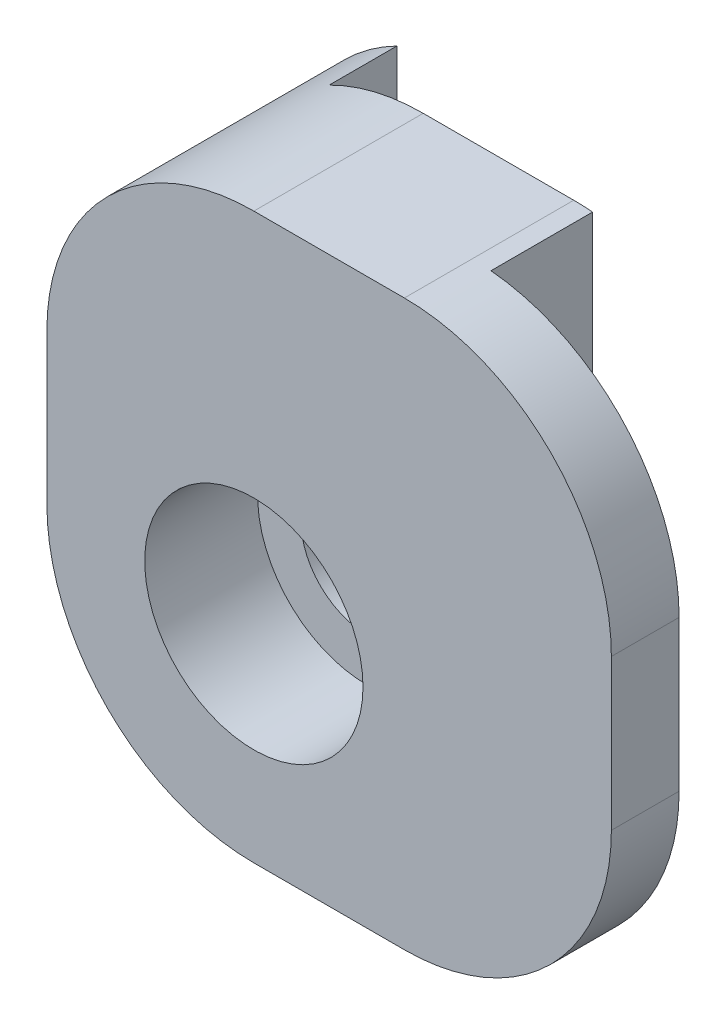
ISO-10303-21;
HEADER;
FILE_DESCRIPTION(('STEP AP214'),'2;1');
FILE_NAME('part.step','',(''),(''),'','','');
FILE_SCHEMA(('AUTOMOTIVE_DESIGN { 1 0 10303 214 1 1 1 1 }'));
ENDSEC;
DATA;
#1=APPLICATION_CONTEXT('core data for automotive mechanical design processes');
#2=APPLICATION_PROTOCOL_DEFINITION('international standard','automotive_design',2000,#1);
#3=PRODUCT_CONTEXT('',#1,'mechanical');
#4=PRODUCT('Part','Part','',(#3));
#5=PRODUCT_RELATED_PRODUCT_CATEGORY('part','',(#4));
#6=PRODUCT_DEFINITION_FORMATION('','',#4);
#7=PRODUCT_DEFINITION_CONTEXT('part definition',#1,'design');
#8=PRODUCT_DEFINITION('design','',#6,#7);
#9=PRODUCT_DEFINITION_SHAPE('','',#8);
#10=(LENGTH_UNIT() NAMED_UNIT(*) SI_UNIT(.MILLI.,.METRE.));
#11=(NAMED_UNIT(*) PLANE_ANGLE_UNIT() SI_UNIT($,.RADIAN.));
#12=(NAMED_UNIT(*) SI_UNIT($,.STERADIAN.) SOLID_ANGLE_UNIT());
#13=UNCERTAINTY_MEASURE_WITH_UNIT(LENGTH_MEASURE(1.E-05),#10,'distance_accuracy_value','');
#14=(GEOMETRIC_REPRESENTATION_CONTEXT(3) GLOBAL_UNCERTAINTY_ASSIGNED_CONTEXT((#13)) GLOBAL_UNIT_ASSIGNED_CONTEXT((#10,
#11,#12)) REPRESENTATION_CONTEXT('',''));
#15=CARTESIAN_POINT('',(0.,0.,0.));
#16=DIRECTION('',(0.,0.,1.));
#17=DIRECTION('',(1.,0.,0.));
#18=AXIS2_PLACEMENT_3D('',#15,#16,#17);
#19=CARTESIAN_POINT('',(10.5,2.5,2.7));
#20=DIRECTION('',(0.,0.,-1.));
#21=DIRECTION('',(1.,0.,0.));
#22=AXIS2_PLACEMENT_3D('',#19,#20,#21);
#23=CYLINDRICAL_SURFACE('',#22,1.75);
#24=CARTESIAN_POINT('',(10.5,2.5,0.));
#25=DIRECTION('',(0.,0.,-1.));
#26=DIRECTION('',(-1.,0.,0.));
#27=AXIS2_PLACEMENT_3D('',#24,#25,#26);
#28=CIRCLE('',#27,1.75);
#29=CARTESIAN_POINT('',(8.75,2.5,0.));
#30=VERTEX_POINT('',#29);
#31=EDGE_CURVE('E197',#30,#30,#28,.T.);
#32=ORIENTED_EDGE('',*,*,#31,.T.);
#33=EDGE_LOOP('',(#32));
#34=FACE_BOUND('',#33,.T.);
#35=CARTESIAN_POINT('',(10.5,2.5,1.5));
#36=DIRECTION('',(0.,0.,1.));
#37=DIRECTION('',(1.,0.,0.));
#38=AXIS2_PLACEMENT_3D('',#35,#36,#37);
#39=CIRCLE('',#38,1.75);
#40=CARTESIAN_POINT('',(12.25,2.5,1.5));
#41=VERTEX_POINT('',#40);
#42=EDGE_CURVE('E42',#41,#41,#39,.T.);
#43=ORIENTED_EDGE('',*,*,#42,.T.);
#44=EDGE_LOOP('',(#43));
#45=FACE_BOUND('',#44,.T.);
#46=ADVANCED_FACE('F38',(#34,#45),#23,.F.);
#47=CARTESIAN_POINT('',(20.,0.,0.));
#48=DIRECTION('',(1.,0.,0.));
#49=DIRECTION('',(0.,0.,1.));
#50=AXIS2_PLACEMENT_3D('',#47,#48,#49);
#51=PLANE('',#50);
#52=DIRECTION('',(0.,0.,1.));
#53=VECTOR('',#52,1.);
#54=CARTESIAN_POINT('',(20.,6.5,-9.27817459305208));
#55=LINE('',#54,#53);
#56=CARTESIAN_POINT('',(20.,6.5,4.5));
#57=VERTEX_POINT('',#56);
#58=CARTESIAN_POINT('',(20.,6.5,2.7));
#59=VERTEX_POINT('',#58);
#60=EDGE_CURVE('E11',#57,#59,#55,.F.);
#61=ORIENTED_EDGE('',*,*,#60,.F.);
#62=DIRECTION('',(0.,1.,0.));
#63=VECTOR('',#62,1.);
#64=CARTESIAN_POINT('',(20.,2.5,4.5));
#65=LINE('',#64,#63);
#66=CARTESIAN_POINT('',(20.,2.5,4.5));
#67=VERTEX_POINT('',#66);
#68=EDGE_CURVE('E134',#67,#57,#65,.T.);
#69=ORIENTED_EDGE('',*,*,#68,.F.);
#70=DIRECTION('',(0.,0.,1.));
#71=VECTOR('',#70,1.);
#72=CARTESIAN_POINT('',(20.,2.5,-9.27817459305202));
#73=LINE('',#72,#71);
#74=CARTESIAN_POINT('',(20.,2.5,2.7));
#75=VERTEX_POINT('',#74);
#76=EDGE_CURVE('E144',#75,#67,#73,.T.);
#77=ORIENTED_EDGE('',*,*,#76,.F.);
#78=DIRECTION('',(0.,-1.,0.));
#79=VECTOR('',#78,1.);
#80=CARTESIAN_POINT('',(20.,12.,2.7));
#81=LINE('',#80,#79);
#82=EDGE_CURVE('E195',#59,#75,#81,.T.);
#83=ORIENTED_EDGE('',*,*,#82,.F.);
#84=EDGE_LOOP('',(#61,#69,#77,#83));
#85=FACE_BOUND('',#84,.T.);
#86=ADVANCED_FACE('F142',(#85),#51,.T.);
#87=CARTESIAN_POINT('',(8.,12.,2.7));
#88=DIRECTION('',(0.,-1.,0.));
#89=DIRECTION('',(0.,0.,-1.));
#90=AXIS2_PLACEMENT_3D('',#87,#88,#89);
#91=PLANE('',#90);
#92=DIRECTION('',(-1.,0.,0.));
#93=VECTOR('',#92,1.);
#94=CARTESIAN_POINT('',(14.5,12.,4.5));
#95=LINE('',#94,#93);
#96=CARTESIAN_POINT('',(14.5,12.,4.5));
#97=VERTEX_POINT('',#96);
#98=CARTESIAN_POINT('',(10.5,12.,4.5));
#99=VERTEX_POINT('',#98);
#100=EDGE_CURVE('E273',#97,#99,#95,.T.);
#101=ORIENTED_EDGE('',*,*,#100,.F.);
#102=DIRECTION('',(0.,0.,1.));
#103=VECTOR('',#102,1.);
#104=CARTESIAN_POINT('',(14.5,12.,-9.27817459305208));
#105=LINE('',#104,#103);
#106=CARTESIAN_POINT('',(14.5,12.,0.));
#107=VERTEX_POINT('',#106);
#108=EDGE_CURVE('E163',#107,#97,#105,.T.);
#109=ORIENTED_EDGE('',*,*,#108,.F.);
#110=DIRECTION('',(1.,0.,0.));
#111=VECTOR('',#110,1.);
#112=CARTESIAN_POINT('',(8.,12.,0.));
#113=LINE('',#112,#111);
#114=CARTESIAN_POINT('',(10.5,12.,0.));
#115=VERTEX_POINT('',#114);
#116=EDGE_CURVE('E202',#115,#107,#113,.T.);
#117=ORIENTED_EDGE('',*,*,#116,.F.);
#118=DIRECTION('',(0.,0.,1.));
#119=VECTOR('',#118,1.);
#120=CARTESIAN_POINT('',(10.5,12.,-9.27817459305208));
#121=LINE('',#120,#119);
#122=EDGE_CURVE('E167',#115,#99,#121,.T.);
#123=ORIENTED_EDGE('',*,*,#122,.T.);
#124=EDGE_LOOP('',(#101,#109,#117,#123));
#125=FACE_BOUND('',#124,.T.);
#126=ADVANCED_FACE('F272',(#125),#91,.F.);
#127=CARTESIAN_POINT('',(8.,-3.,0.));
#128=DIRECTION('',(0.,-1.,0.));
#129=DIRECTION('',(-1.,0.,0.));
#130=AXIS2_PLACEMENT_3D('',#127,#128,#129);
#131=PLANE('',#130);
#132=DIRECTION('',(0.,0.,1.));
#133=VECTOR('',#132,1.);
#134=CARTESIAN_POINT('',(14.5,-3.,-9.27817459305202));
#135=LINE('',#134,#133);
#136=CARTESIAN_POINT('',(14.5,-3.,-1.8));
#137=VERTEX_POINT('',#136);
#138=CARTESIAN_POINT('',(14.5,-3.,4.5));
#139=VERTEX_POINT('',#138);
#140=EDGE_CURVE('E151',#137,#139,#135,.T.);
#141=ORIENTED_EDGE('',*,*,#140,.T.);
#142=DIRECTION('',(1.,0.,0.));
#143=VECTOR('',#142,1.);
#144=CARTESIAN_POINT('',(10.5,-3.,4.5));
#145=LINE('',#144,#143);
#146=CARTESIAN_POINT('',(10.5,-3.,4.5));
#147=VERTEX_POINT('',#146);
#148=EDGE_CURVE('E54',#147,#139,#145,.T.);
#149=ORIENTED_EDGE('',*,*,#148,.F.);
#150=DIRECTION('',(0.,0.,-1.));
#151=VECTOR('',#150,1.);
#152=CARTESIAN_POINT('',(10.5,-3.,0.));
#153=LINE('',#152,#151);
#154=CARTESIAN_POINT('',(10.5,-3.,-1.8));
#155=VERTEX_POINT('',#154);
#156=EDGE_CURVE('E47',#155,#147,#153,.F.);
#157=ORIENTED_EDGE('',*,*,#156,.F.);
#158=DIRECTION('',(1.,0.,0.));
#159=VECTOR('',#158,1.);
#160=CARTESIAN_POINT('',(10.5,-3.,-1.8));
#161=LINE('',#160,#159);
#162=EDGE_CURVE('E222',#155,#137,#161,.T.);
#163=ORIENTED_EDGE('',*,*,#162,.T.);
#164=EDGE_LOOP('',(#141,#149,#157,#163));
#165=FACE_BOUND('',#164,.T.);
#166=ADVANCED_FACE('F221',(#165),#131,.T.);
#167=CARTESIAN_POINT('',(5.,0.,0.));
#168=DIRECTION('',(-1.,0.,0.));
#169=DIRECTION('',(0.,0.,-1.));
#170=AXIS2_PLACEMENT_3D('',#167,#168,#169);
#171=PLANE('',#170);
#172=DIRECTION('',(0.,0.,-1.));
#173=VECTOR('',#172,1.);
#174=CARTESIAN_POINT('',(5.,2.5,0.));
#175=LINE('',#174,#173);
#176=CARTESIAN_POINT('',(5.,2.5,4.5));
#177=VERTEX_POINT('',#176);
#178=CARTESIAN_POINT('',(5.,2.5,-1.8));
#179=VERTEX_POINT('',#178);
#180=EDGE_CURVE('E208',#177,#179,#175,.T.);
#181=ORIENTED_EDGE('',*,*,#180,.F.);
#182=DIRECTION('',(0.,-1.,0.));
#183=VECTOR('',#182,1.);
#184=CARTESIAN_POINT('',(5.,6.49999999999996,4.5));
#185=LINE('',#184,#183);
#186=CARTESIAN_POINT('',(5.,6.49999999999997,4.5));
#187=VERTEX_POINT('',#186);
#188=EDGE_CURVE('E227',#187,#177,#185,.T.);
#189=ORIENTED_EDGE('',*,*,#188,.F.);
#190=DIRECTION('',(0.,0.,1.));
#191=VECTOR('',#190,1.);
#192=CARTESIAN_POINT('',(5.,6.49999999999996,-9.27817459305208));
#193=LINE('',#192,#191);
#194=CARTESIAN_POINT('',(5.,6.49999999999997,-1.8));
#195=VERTEX_POINT('',#194);
#196=EDGE_CURVE('E162',#195,#187,#193,.T.);
#197=ORIENTED_EDGE('',*,*,#196,.F.);
#198=DIRECTION('',(0.,-1.,0.));
#199=VECTOR('',#198,1.);
#200=CARTESIAN_POINT('',(5.,6.49999999999996,-1.8));
#201=LINE('',#200,#199);
#202=EDGE_CURVE('E155',#195,#179,#201,.T.);
#203=ORIENTED_EDGE('',*,*,#202,.T.);
#204=EDGE_LOOP('',(#181,#189,#197,#203));
#205=FACE_BOUND('',#204,.T.);
#206=ADVANCED_FACE('F249',(#205),#171,.T.);
#207=CARTESIAN_POINT('',(10.5,2.5,1.8));
#208=DIRECTION('',(0.,0.,1.));
#209=DIRECTION('',(-1.,0.,0.));
#210=AXIS2_PLACEMENT_3D('',#207,#208,#209);
#211=CYLINDRICAL_SURFACE('',#210,2.9);
#212=CARTESIAN_POINT('',(10.5,2.5,4.5));
#213=DIRECTION('',(0.,0.,1.));
#214=DIRECTION('',(1.,0.,0.));
#215=AXIS2_PLACEMENT_3D('',#212,#213,#214);
#216=CIRCLE('',#215,2.9);
#217=CARTESIAN_POINT('',(13.4,2.5,4.5));
#218=VERTEX_POINT('',#217);
#219=EDGE_CURVE('E223',#218,#218,#216,.F.);
#220=ORIENTED_EDGE('',*,*,#219,.F.);
#221=EDGE_LOOP('',(#220));
#222=FACE_BOUND('',#221,.T.);
#223=CARTESIAN_POINT('',(10.5,2.5,1.5));
#224=DIRECTION('',(0.,0.,1.));
#225=DIRECTION('',(1.,0.,0.));
#226=AXIS2_PLACEMENT_3D('',#223,#224,#225);
#227=CIRCLE('',#226,2.9);
#228=CARTESIAN_POINT('',(13.4,2.5,1.5));
#229=VERTEX_POINT('',#228);
#230=EDGE_CURVE('E325',#229,#229,#227,.T.);
#231=ORIENTED_EDGE('',*,*,#230,.F.);
#232=EDGE_LOOP('',(#231));
#233=FACE_BOUND('',#232,.T.);
#234=ADVANCED_FACE('F314',(#222,#233),#211,.F.);
#235=CARTESIAN_POINT('',(10.5,2.5,0.));
#236=DIRECTION('',(0.,0.,-1.));
#237=DIRECTION('',(1.,0.,0.));
#238=AXIS2_PLACEMENT_3D('',#235,#236,#237);
#239=CYLINDRICAL_SURFACE('',#238,5.5);
#240=ORIENTED_EDGE('',*,*,#156,.T.);
#241=CARTESIAN_POINT('',(10.5,2.5,4.5));
#242=DIRECTION('',(0.,0.,1.));
#243=DIRECTION('',(1.,0.,0.));
#244=AXIS2_PLACEMENT_3D('',#241,#242,#243);
#245=CIRCLE('',#244,5.5);
#246=EDGE_CURVE('E214',#177,#147,#245,.T.);
#247=ORIENTED_EDGE('',*,*,#246,.F.);
#248=ORIENTED_EDGE('',*,*,#180,.T.);
#249=CARTESIAN_POINT('',(10.5,2.5,-1.8));
#250=DIRECTION('',(0.,0.,1.));
#251=DIRECTION('',(1.,0.,0.));
#252=AXIS2_PLACEMENT_3D('',#249,#250,#251);
#253=CIRCLE('',#252,5.5);
#254=EDGE_CURVE('E217',#179,#155,#253,.T.);
#255=ORIENTED_EDGE('',*,*,#254,.T.);
#256=EDGE_LOOP('',(#240,#247,#248,#255));
#257=FACE_BOUND('',#256,.T.);
#258=ADVANCED_FACE('F40',(#257),#239,.T.);
#259=CARTESIAN_POINT('',(10.5,6.5,-9.27817459305208));
#260=DIRECTION('',(0.,0.,1.));
#261=DIRECTION('',(-1.,0.,0.));
#262=AXIS2_PLACEMENT_3D('',#259,#260,#261);
#263=CYLINDRICAL_SURFACE('',#262,5.5);
#264=CARTESIAN_POINT('',(10.5,6.5,4.5));
#265=DIRECTION('',(0.,0.,1.));
#266=DIRECTION('',(1.,0.,0.));
#267=AXIS2_PLACEMENT_3D('',#264,#265,#266);
#268=CIRCLE('',#267,5.5);
#269=EDGE_CURVE('E275',#99,#187,#268,.T.);
#270=ORIENTED_EDGE('',*,*,#269,.F.);
#271=ORIENTED_EDGE('',*,*,#122,.F.);
#272=CARTESIAN_POINT('',(10.5,6.5,0.));
#273=DIRECTION('',(0.,0.,-1.));
#274=DIRECTION('',(-1.,0.,0.));
#275=AXIS2_PLACEMENT_3D('',#272,#273,#274);
#276=CIRCLE('',#275,5.5);
#277=CARTESIAN_POINT('',(8.,11.3989794855664,0.));
#278=VERTEX_POINT('',#277);
#279=EDGE_CURVE('E174',#115,#278,#276,.F.);
#280=ORIENTED_EDGE('',*,*,#279,.T.);
#281=DIRECTION('',(0.,0.,1.));
#282=VECTOR('',#281,1.);
#283=CARTESIAN_POINT('',(8.,11.3989794855664,-9.27817459305208));
#284=LINE('',#283,#282);
#285=CARTESIAN_POINT('',(8.,11.3989794855664,-1.8));
#286=VERTEX_POINT('',#285);
#287=EDGE_CURVE('E166',#278,#286,#284,.F.);
#288=ORIENTED_EDGE('',*,*,#287,.T.);
#289=CARTESIAN_POINT('',(10.5,6.5,-1.8));
#290=DIRECTION('',(0.,0.,1.));
#291=DIRECTION('',(1.,0.,0.));
#292=AXIS2_PLACEMENT_3D('',#289,#290,#291);
#293=CIRCLE('',#292,5.5);
#294=EDGE_CURVE('E243',#286,#195,#293,.T.);
#295=ORIENTED_EDGE('',*,*,#294,.T.);
#296=ORIENTED_EDGE('',*,*,#196,.T.);
#297=EDGE_LOOP('',(#270,#271,#280,#288,#295,#296));
#298=FACE_BOUND('',#297,.T.);
#299=ADVANCED_FACE('F279',(#298),#263,.T.);
#300=CARTESIAN_POINT('',(14.5,6.5,-9.27817459305208));
#301=DIRECTION('',(0.,0.,1.));
#302=DIRECTION('',(-1.,0.,0.));
#303=AXIS2_PLACEMENT_3D('',#300,#301,#302);
#304=CYLINDRICAL_SURFACE('',#303,5.5);
#305=CARTESIAN_POINT('',(14.5,6.5,4.5));
#306=DIRECTION('',(0.,0.,1.));
#307=DIRECTION('',(1.,0.,0.));
#308=AXIS2_PLACEMENT_3D('',#305,#306,#307);
#309=CIRCLE('',#308,5.5);
#310=EDGE_CURVE('E146',#57,#97,#309,.T.);
#311=ORIENTED_EDGE('',*,*,#310,.F.);
#312=ORIENTED_EDGE('',*,*,#60,.T.);
#313=CARTESIAN_POINT('',(14.5,6.5,2.7));
#314=DIRECTION('',(0.,0.,-1.));
#315=DIRECTION('',(0.,-1.,0.));
#316=AXIS2_PLACEMENT_3D('',#313,#314,#315);
#317=CIRCLE('',#316,5.5);
#318=CARTESIAN_POINT('',(15.,11.9772255750517,2.7));
#319=VERTEX_POINT('',#318);
#320=EDGE_CURVE('E177',#59,#319,#317,.F.);
#321=ORIENTED_EDGE('',*,*,#320,.T.);
#322=DIRECTION('',(0.,0.,1.));
#323=VECTOR('',#322,1.);
#324=CARTESIAN_POINT('',(15.,11.9772255750517,-9.27817459305208));
#325=LINE('',#324,#323);
#326=CARTESIAN_POINT('',(15.,11.9772255750517,0.));
#327=VERTEX_POINT('',#326);
#328=EDGE_CURVE('E179',#319,#327,#325,.F.);
#329=ORIENTED_EDGE('',*,*,#328,.T.);
#330=CARTESIAN_POINT('',(14.5,6.5,0.));
#331=DIRECTION('',(0.,0.,-1.));
#332=DIRECTION('',(-1.,0.,0.));
#333=AXIS2_PLACEMENT_3D('',#330,#331,#332);
#334=CIRCLE('',#333,5.5);
#335=EDGE_CURVE('E182',#327,#107,#334,.F.);
#336=ORIENTED_EDGE('',*,*,#335,.T.);
#337=ORIENTED_EDGE('',*,*,#108,.T.);
#338=EDGE_LOOP('',(#311,#312,#321,#329,#336,#337));
#339=FACE_BOUND('',#338,.T.);
#340=ADVANCED_FACE('F261',(#339),#304,.T.);
#341=CARTESIAN_POINT('',(14.5,2.5,-9.27817459305202));
#342=DIRECTION('',(0.,0.,1.));
#343=DIRECTION('',(-1.,0.,0.));
#344=AXIS2_PLACEMENT_3D('',#341,#342,#343);
#345=CYLINDRICAL_SURFACE('',#344,5.5);
#346=ORIENTED_EDGE('',*,*,#76,.T.);
#347=CARTESIAN_POINT('',(14.5,2.5,4.5));
#348=DIRECTION('',(0.,0.,1.));
#349=DIRECTION('',(1.,0.,0.));
#350=AXIS2_PLACEMENT_3D('',#347,#348,#349);
#351=CIRCLE('',#350,5.5);
#352=EDGE_CURVE('E130',#139,#67,#351,.T.);
#353=ORIENTED_EDGE('',*,*,#352,.F.);
#354=ORIENTED_EDGE('',*,*,#140,.F.);
#355=CARTESIAN_POINT('',(14.5,2.5,-1.8));
#356=DIRECTION('',(0.,0.,1.));
#357=DIRECTION('',(1.,0.,0.));
#358=AXIS2_PLACEMENT_3D('',#355,#356,#357);
#359=CIRCLE('',#358,5.5);
#360=CARTESIAN_POINT('',(15.,-2.97722557505166,-1.8));
#361=VERTEX_POINT('',#360);
#362=EDGE_CURVE('E233',#137,#361,#359,.T.);
#363=ORIENTED_EDGE('',*,*,#362,.T.);
#364=DIRECTION('',(0.,0.,1.));
#365=VECTOR('',#364,1.);
#366=CARTESIAN_POINT('',(15.,-2.97722557505166,-9.27817459305202));
#367=LINE('',#366,#365);
#368=CARTESIAN_POINT('',(15.,-2.97722557505166,2.7));
#369=VERTEX_POINT('',#368);
#370=EDGE_CURVE('E153',#369,#361,#367,.F.);
#371=ORIENTED_EDGE('',*,*,#370,.F.);
#372=CARTESIAN_POINT('',(14.5,2.5,2.7));
#373=DIRECTION('',(0.,0.,-1.));
#374=DIRECTION('',(0.,-1.,0.));
#375=AXIS2_PLACEMENT_3D('',#372,#373,#374);
#376=CIRCLE('',#375,5.5);
#377=EDGE_CURVE('E150',#75,#369,#376,.T.);
#378=ORIENTED_EDGE('',*,*,#377,.F.);
#379=EDGE_LOOP('',(#346,#353,#354,#363,#371,#378));
#380=FACE_BOUND('',#379,.T.);
#381=ADVANCED_FACE('F148',(#380),#345,.T.);
#382=CARTESIAN_POINT('',(15.,0.,2.7));
#383=DIRECTION('',(-1.,0.,0.));
#384=DIRECTION('',(0.,0.,-1.));
#385=AXIS2_PLACEMENT_3D('',#382,#383,#384);
#386=PLANE('',#385);
#387=ORIENTED_EDGE('',*,*,#370,.T.);
#388=DIRECTION('',(0.,1.,0.));
#389=VECTOR('',#388,1.);
#390=CARTESIAN_POINT('',(15.,-2.97722557505166,-1.8));
#391=LINE('',#390,#389);
#392=CARTESIAN_POINT('',(15.,0.,-1.8));
#393=VERTEX_POINT('',#392);
#394=EDGE_CURVE('E235',#361,#393,#391,.T.);
#395=ORIENTED_EDGE('',*,*,#394,.T.);
#396=DIRECTION('',(0.,0.,1.));
#397=VECTOR('',#396,1.);
#398=CARTESIAN_POINT('',(15.,0.,-1.5));
#399=LINE('',#398,#397);
#400=CARTESIAN_POINT('',(15.,0.,0.));
#401=VERTEX_POINT('',#400);
#402=EDGE_CURVE('E189',#393,#401,#399,.T.);
#403=ORIENTED_EDGE('',*,*,#402,.T.);
#404=DIRECTION('',(0.,-1.,0.));
#405=VECTOR('',#404,1.);
#406=CARTESIAN_POINT('',(15.,0.,0.));
#407=LINE('',#406,#405);
#408=EDGE_CURVE('E205',#327,#401,#407,.T.);
#409=ORIENTED_EDGE('',*,*,#408,.F.);
#410=ORIENTED_EDGE('',*,*,#328,.F.);
#411=DIRECTION('',(0.,-1.,0.));
#412=VECTOR('',#411,1.);
#413=CARTESIAN_POINT('',(15.,12.,2.7));
#414=LINE('',#413,#412);
#415=EDGE_CURVE('E194',#319,#369,#414,.T.);
#416=ORIENTED_EDGE('',*,*,#415,.T.);
#417=EDGE_LOOP('',(#387,#395,#403,#409,#410,#416));
#418=FACE_BOUND('',#417,.T.);
#419=ADVANCED_FACE('F255',(#418),#386,.F.);
#420=CARTESIAN_POINT('',(20.,12.,2.7));
#421=DIRECTION('',(0.,0.,1.));
#422=DIRECTION('',(0.,-1.,0.));
#423=AXIS2_PLACEMENT_3D('',#420,#421,#422);
#424=PLANE('',#423);
#425=ORIENTED_EDGE('',*,*,#377,.T.);
#426=ORIENTED_EDGE('',*,*,#415,.F.);
#427=ORIENTED_EDGE('',*,*,#320,.F.);
#428=ORIENTED_EDGE('',*,*,#82,.T.);
#429=EDGE_LOOP('',(#425,#426,#427,#428));
#430=FACE_BOUND('',#429,.T.);
#431=ADVANCED_FACE('F260',(#430),#424,.F.);
#432=CARTESIAN_POINT('',(8.,0.,0.));
#433=DIRECTION('',(0.,0.,1.));
#434=DIRECTION('',(-1.,0.,0.));
#435=AXIS2_PLACEMENT_3D('',#432,#433,#434);
#436=PLANE('',#435);
#437=ORIENTED_EDGE('',*,*,#408,.T.);
#438=DIRECTION('',(1.,0.,0.));
#439=VECTOR('',#438,1.);
#440=CARTESIAN_POINT('',(8.,0.,0.));
#441=LINE('',#440,#439);
#442=CARTESIAN_POINT('',(8.,0.,0.));
#443=VERTEX_POINT('',#442);
#444=EDGE_CURVE('E184',#443,#401,#441,.T.);
#445=ORIENTED_EDGE('',*,*,#444,.F.);
#446=DIRECTION('',(0.,1.,0.));
#447=VECTOR('',#446,1.);
#448=CARTESIAN_POINT('',(8.,0.,0.));
#449=LINE('',#448,#447);
#450=EDGE_CURVE('E186',#443,#278,#449,.T.);
#451=ORIENTED_EDGE('',*,*,#450,.T.);
#452=ORIENTED_EDGE('',*,*,#279,.F.);
#453=ORIENTED_EDGE('',*,*,#116,.T.);
#454=ORIENTED_EDGE('',*,*,#335,.F.);
#455=EDGE_LOOP('',(#437,#445,#451,#452,#453,#454));
#456=FACE_BOUND('',#455,.T.);
#457=ORIENTED_EDGE('',*,*,#31,.F.);
#458=EDGE_LOOP('',(#457));
#459=FACE_BOUND('',#458,.T.);
#460=ADVANCED_FACE('F265',(#456,#459),#436,.F.);
#461=CARTESIAN_POINT('',(8.,0.,-1.5));
#462=DIRECTION('',(0.,1.,0.));
#463=DIRECTION('',(0.,0.,1.));
#464=AXIS2_PLACEMENT_3D('',#461,#462,#463);
#465=PLANE('',#464);
#466=ORIENTED_EDGE('',*,*,#444,.T.);
#467=ORIENTED_EDGE('',*,*,#402,.F.);
#468=DIRECTION('',(-1.,0.,0.));
#469=VECTOR('',#468,1.);
#470=CARTESIAN_POINT('',(15.,0.,-1.8));
#471=LINE('',#470,#469);
#472=CARTESIAN_POINT('',(8.,0.,-1.8));
#473=VERTEX_POINT('',#472);
#474=EDGE_CURVE('E238',#393,#473,#471,.T.);
#475=ORIENTED_EDGE('',*,*,#474,.T.);
#476=DIRECTION('',(0.,0.,1.));
#477=VECTOR('',#476,1.);
#478=CARTESIAN_POINT('',(8.,0.,-1.5));
#479=LINE('',#478,#477);
#480=EDGE_CURVE('E192',#473,#443,#479,.T.);
#481=ORIENTED_EDGE('',*,*,#480,.T.);
#482=EDGE_LOOP('',(#466,#467,#475,#481));
#483=FACE_BOUND('',#482,.T.);
#484=ADVANCED_FACE('F285',(#483),#465,.T.);
#485=CARTESIAN_POINT('',(8.,0.,-1.5));
#486=DIRECTION('',(-1.,0.,0.));
#487=DIRECTION('',(0.,0.,-1.));
#488=AXIS2_PLACEMENT_3D('',#485,#486,#487);
#489=PLANE('',#488);
#490=ORIENTED_EDGE('',*,*,#450,.F.);
#491=ORIENTED_EDGE('',*,*,#480,.F.);
#492=DIRECTION('',(0.,1.,0.));
#493=VECTOR('',#492,1.);
#494=CARTESIAN_POINT('',(8.,0.,-1.8));
#495=LINE('',#494,#493);
#496=EDGE_CURVE('E241',#473,#286,#495,.T.);
#497=ORIENTED_EDGE('',*,*,#496,.T.);
#498=ORIENTED_EDGE('',*,*,#287,.F.);
#499=EDGE_LOOP('',(#490,#491,#497,#498));
#500=FACE_BOUND('',#499,.T.);
#501=ADVANCED_FACE('F283',(#500),#489,.F.);
#502=CARTESIAN_POINT('',(10.5,2.5,-1.8));
#503=DIRECTION('',(0.,0.,-1.));
#504=DIRECTION('',(1.,0.,0.));
#505=AXIS2_PLACEMENT_3D('',#502,#503,#504);
#506=PLANE('',#505);
#507=ORIENTED_EDGE('',*,*,#254,.F.);
#508=ORIENTED_EDGE('',*,*,#202,.F.);
#509=ORIENTED_EDGE('',*,*,#294,.F.);
#510=ORIENTED_EDGE('',*,*,#496,.F.);
#511=ORIENTED_EDGE('',*,*,#474,.F.);
#512=ORIENTED_EDGE('',*,*,#394,.F.);
#513=ORIENTED_EDGE('',*,*,#362,.F.);
#514=ORIENTED_EDGE('',*,*,#162,.F.);
#515=EDGE_LOOP('',(#507,#508,#509,#510,#511,#512,#513,#514));
#516=FACE_BOUND('',#515,.T.);
#517=ADVANCED_FACE('F252',(#516),#506,.T.);
#518=CARTESIAN_POINT('',(14.5,2.5,4.5));
#519=DIRECTION('',(0.,0.,1.));
#520=DIRECTION('',(1.,0.,0.));
#521=AXIS2_PLACEMENT_3D('',#518,#519,#520);
#522=PLANE('',#521);
#523=ORIENTED_EDGE('',*,*,#352,.T.);
#524=ORIENTED_EDGE('',*,*,#68,.T.);
#525=ORIENTED_EDGE('',*,*,#310,.T.);
#526=ORIENTED_EDGE('',*,*,#100,.T.);
#527=ORIENTED_EDGE('',*,*,#269,.T.);
#528=ORIENTED_EDGE('',*,*,#188,.T.);
#529=ORIENTED_EDGE('',*,*,#246,.T.);
#530=ORIENTED_EDGE('',*,*,#148,.T.);
#531=EDGE_LOOP('',(#523,#524,#525,#526,#527,#528,#529,#530));
#532=FACE_BOUND('',#531,.T.);
#533=ORIENTED_EDGE('',*,*,#219,.T.);
#534=EDGE_LOOP('',(#533));
#535=FACE_BOUND('',#534,.T.);
#536=ADVANCED_FACE('F132',(#532,#535),#522,.T.);
#537=CARTESIAN_POINT('',(10.5,2.5,1.5));
#538=DIRECTION('',(0.,0.,1.));
#539=DIRECTION('',(1.,0.,0.));
#540=AXIS2_PLACEMENT_3D('',#537,#538,#539);
#541=PLANE('',#540);
#542=ORIENTED_EDGE('',*,*,#42,.F.);
#543=EDGE_LOOP('',(#542));
#544=FACE_BOUND('',#543,.T.);
#545=ORIENTED_EDGE('',*,*,#230,.T.);
#546=EDGE_LOOP('',(#545));
#547=FACE_BOUND('',#546,.T.);
#548=ADVANCED_FACE('F331',(#544,#547),#541,.T.);
#549=CLOSED_SHELL('',(#46,#86,#126,#166,#206,#234,#258,#299,#340,#381,#419,#431,#460,#484,#501,
#517,#536,#548));
#550=MANIFOLD_SOLID_BREP('B2',#549);
#551=ADVANCED_BREP_SHAPE_REPRESENTATION('',(#18,#550),#14);
#552=SHAPE_DEFINITION_REPRESENTATION(#9,#551);
ENDSEC;
END-ISO-10303-21;
